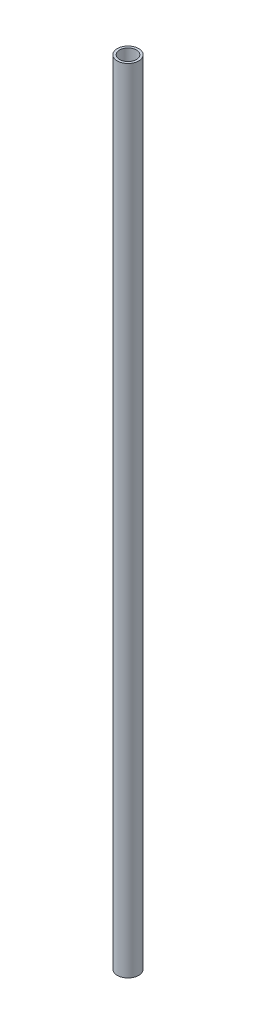
ISO-10303-21;
HEADER;
FILE_DESCRIPTION(('STEP AP214'),'2;1');
FILE_NAME('part.step','',(''),(''),'','','');
FILE_SCHEMA(('AUTOMOTIVE_DESIGN { 1 0 10303 214 1 1 1 1 }'));
ENDSEC;
DATA;
#1=APPLICATION_CONTEXT('core data for automotive mechanical design processes');
#2=APPLICATION_PROTOCOL_DEFINITION('international standard','automotive_design',2000,#1);
#3=PRODUCT_CONTEXT('',#1,'mechanical');
#4=PRODUCT('Part','Part','',(#3));
#5=PRODUCT_RELATED_PRODUCT_CATEGORY('part','',(#4));
#6=PRODUCT_DEFINITION_FORMATION('','',#4);
#7=PRODUCT_DEFINITION_CONTEXT('part definition',#1,'design');
#8=PRODUCT_DEFINITION('design','',#6,#7);
#9=PRODUCT_DEFINITION_SHAPE('','',#8);
#10=(LENGTH_UNIT() NAMED_UNIT(*) SI_UNIT(.MILLI.,.METRE.));
#11=(NAMED_UNIT(*) PLANE_ANGLE_UNIT() SI_UNIT($,.RADIAN.));
#12=(NAMED_UNIT(*) SI_UNIT($,.STERADIAN.) SOLID_ANGLE_UNIT());
#13=UNCERTAINTY_MEASURE_WITH_UNIT(LENGTH_MEASURE(1.E-05),#10,'distance_accuracy_value','');
#14=(GEOMETRIC_REPRESENTATION_CONTEXT(3) GLOBAL_UNCERTAINTY_ASSIGNED_CONTEXT((#13)) GLOBAL_UNIT_ASSIGNED_CONTEXT((#10,
#11,#12)) REPRESENTATION_CONTEXT('',''));
#15=CARTESIAN_POINT('',(0.,0.,0.));
#16=DIRECTION('',(0.,0.,1.));
#17=DIRECTION('',(1.,0.,0.));
#18=AXIS2_PLACEMENT_3D('',#15,#16,#17);
#19=CARTESIAN_POINT('',(0.,300.,0.));
#20=DIRECTION('',(0.,1.,0.));
#21=DIRECTION('',(0.,0.,1.));
#22=AXIS2_PLACEMENT_3D('',#19,#20,#21);
#23=PLANE('',#22);
#24=CARTESIAN_POINT('',(0.,300.,0.));
#25=DIRECTION('',(0.,1.,0.));
#26=DIRECTION('',(0.,0.,1.));
#27=AXIS2_PLACEMENT_3D('',#24,#25,#26);
#28=CIRCLE('',#27,4.06400000000001);
#29=CARTESIAN_POINT('',(0.,300.,4.06400000000001));
#30=VERTEX_POINT('',#29);
#31=EDGE_CURVE('E10',#30,#30,#28,.T.);
#32=ORIENTED_EDGE('',*,*,#31,.T.);
#33=EDGE_LOOP('',(#32));
#34=FACE_BOUND('',#33,.T.);
#35=CARTESIAN_POINT('',(0.,300.,0.));
#36=DIRECTION('',(0.,1.,0.));
#37=DIRECTION('',(0.,0.,1.));
#38=AXIS2_PLACEMENT_3D('',#35,#36,#37);
#39=CIRCLE('',#38,3.175);
#40=CARTESIAN_POINT('',(0.,300.,3.175));
#41=VERTEX_POINT('',#40);
#42=EDGE_CURVE('E43',#41,#41,#39,.T.);
#43=ORIENTED_EDGE('',*,*,#42,.F.);
#44=EDGE_LOOP('',(#43));
#45=FACE_BOUND('',#44,.T.);
#46=ADVANCED_FACE('F32',(#34,#45),#23,.T.);
#47=CARTESIAN_POINT('',(0.,0.,0.));
#48=DIRECTION('',(0.,1.,0.));
#49=DIRECTION('',(0.,0.,1.));
#50=AXIS2_PLACEMENT_3D('',#47,#48,#49);
#51=PLANE('',#50);
#52=CARTESIAN_POINT('',(0.,0.,0.));
#53=DIRECTION('',(0.,1.,0.));
#54=DIRECTION('',(0.,0.,1.));
#55=AXIS2_PLACEMENT_3D('',#52,#53,#54);
#56=CIRCLE('',#55,4.06400000000001);
#57=CARTESIAN_POINT('',(0.,0.,4.06400000000001));
#58=VERTEX_POINT('',#57);
#59=EDGE_CURVE('E36',#58,#58,#56,.T.);
#60=ORIENTED_EDGE('',*,*,#59,.F.);
#61=EDGE_LOOP('',(#60));
#62=FACE_BOUND('',#61,.T.);
#63=CARTESIAN_POINT('',(0.,0.,0.));
#64=DIRECTION('',(0.,1.,0.));
#65=DIRECTION('',(0.,0.,1.));
#66=AXIS2_PLACEMENT_3D('',#63,#64,#65);
#67=CIRCLE('',#66,3.175);
#68=CARTESIAN_POINT('',(0.,0.,3.175));
#69=VERTEX_POINT('',#68);
#70=EDGE_CURVE('E45',#69,#69,#67,.T.);
#71=ORIENTED_EDGE('',*,*,#70,.T.);
#72=EDGE_LOOP('',(#71));
#73=FACE_BOUND('',#72,.T.);
#74=ADVANCED_FACE('F55',(#62,#73),#51,.F.);
#75=CARTESIAN_POINT('',(0.,300.,0.));
#76=DIRECTION('',(0.,-1.,0.));
#77=DIRECTION('',(0.,0.,-1.));
#78=AXIS2_PLACEMENT_3D('',#75,#76,#77);
#79=CYLINDRICAL_SURFACE('',#78,4.06400000000001);
#80=ORIENTED_EDGE('',*,*,#31,.F.);
#81=EDGE_LOOP('',(#80));
#82=FACE_BOUND('',#81,.T.);
#83=ORIENTED_EDGE('',*,*,#59,.T.);
#84=EDGE_LOOP('',(#83));
#85=FACE_BOUND('',#84,.T.);
#86=ADVANCED_FACE('F34',(#82,#85),#79,.T.);
#87=CARTESIAN_POINT('',(0.,300.,0.));
#88=DIRECTION('',(0.,-1.,0.));
#89=DIRECTION('',(0.,0.,-1.));
#90=AXIS2_PLACEMENT_3D('',#87,#88,#89);
#91=CYLINDRICAL_SURFACE('',#90,3.175);
#92=ORIENTED_EDGE('',*,*,#42,.T.);
#93=EDGE_LOOP('',(#92));
#94=FACE_BOUND('',#93,.T.);
#95=ORIENTED_EDGE('',*,*,#70,.F.);
#96=EDGE_LOOP('',(#95));
#97=FACE_BOUND('',#96,.T.);
#98=ADVANCED_FACE('F51',(#94,#97),#91,.F.);
#99=CLOSED_SHELL('',(#46,#74,#86,#98));
#100=MANIFOLD_SOLID_BREP('B2',#99);
#101=ADVANCED_BREP_SHAPE_REPRESENTATION('',(#18,#100),#14);
#102=SHAPE_DEFINITION_REPRESENTATION(#9,#101);
ENDSEC;
END-ISO-10303-21;
